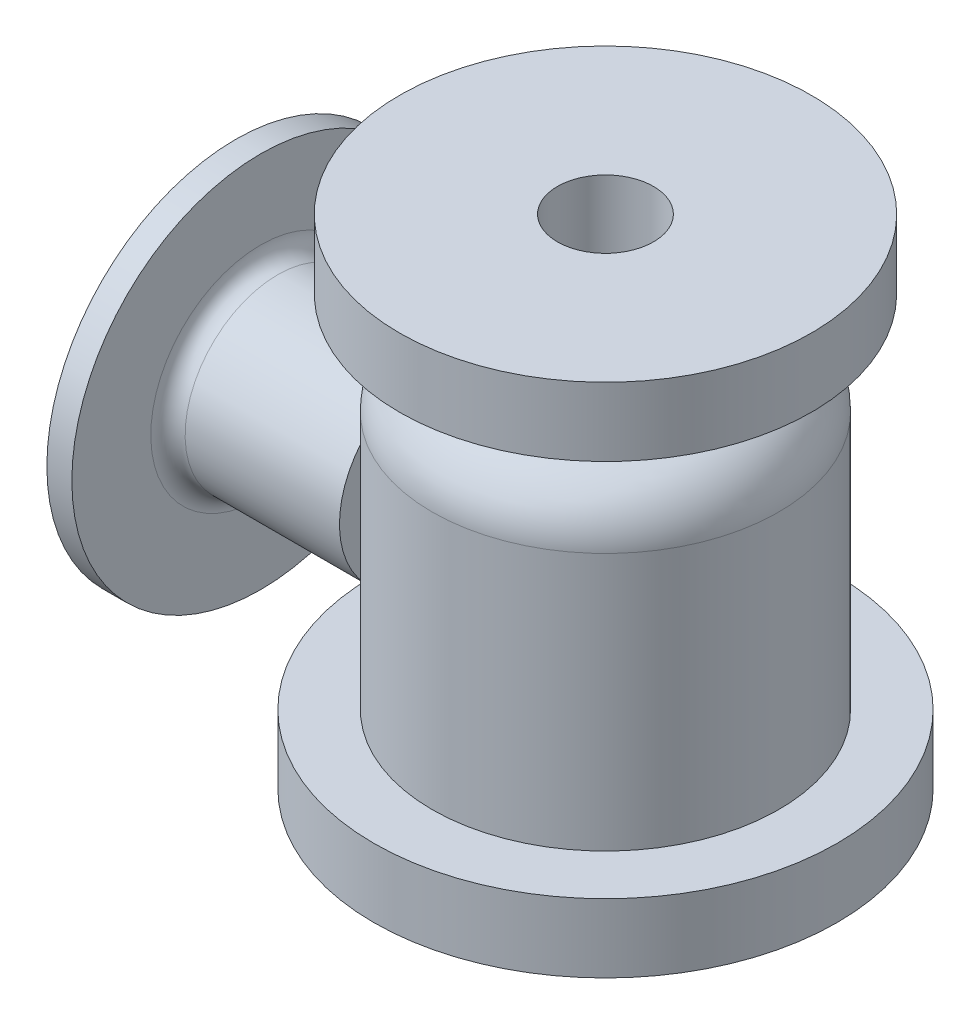
ISO-10303-21;
HEADER;
FILE_DESCRIPTION(('STEP AP214'),'2;1');
FILE_NAME('part.step','',(''),(''),'','','');
FILE_SCHEMA(('AUTOMOTIVE_DESIGN { 1 0 10303 214 1 1 1 1 }'));
ENDSEC;
DATA;
#1=APPLICATION_CONTEXT('core data for automotive mechanical design processes');
#2=APPLICATION_PROTOCOL_DEFINITION('international standard','automotive_design',2000,#1);
#3=PRODUCT_CONTEXT('',#1,'mechanical');
#4=PRODUCT('Part','Part','',(#3));
#5=PRODUCT_RELATED_PRODUCT_CATEGORY('part','',(#4));
#6=PRODUCT_DEFINITION_FORMATION('','',#4);
#7=PRODUCT_DEFINITION_CONTEXT('part definition',#1,'design');
#8=PRODUCT_DEFINITION('design','',#6,#7);
#9=PRODUCT_DEFINITION_SHAPE('','',#8);
#10=(LENGTH_UNIT() NAMED_UNIT(*) SI_UNIT(.MILLI.,.METRE.));
#11=(NAMED_UNIT(*) PLANE_ANGLE_UNIT() SI_UNIT($,.RADIAN.));
#12=(NAMED_UNIT(*) SI_UNIT($,.STERADIAN.) SOLID_ANGLE_UNIT());
#13=UNCERTAINTY_MEASURE_WITH_UNIT(LENGTH_MEASURE(1.E-05),#10,'distance_accuracy_value','');
#14=(GEOMETRIC_REPRESENTATION_CONTEXT(3) GLOBAL_UNCERTAINTY_ASSIGNED_CONTEXT((#13)) GLOBAL_UNIT_ASSIGNED_CONTEXT((#10,
#11,#12)) REPRESENTATION_CONTEXT('',''));
#15=CARTESIAN_POINT('',(0.,0.,0.));
#16=DIRECTION('',(0.,0.,1.));
#17=DIRECTION('',(1.,0.,0.));
#18=AXIS2_PLACEMENT_3D('',#15,#16,#17);
#19=CARTESIAN_POINT('',(-200.93484632486,-11.,0.));
#20=DIRECTION('',(1.,0.,0.));
#21=DIRECTION('',(0.,1.,0.));
#22=AXIS2_PLACEMENT_3D('',#19,#20,#21);
#23=PLANE('',#22);
#24=CARTESIAN_POINT('',(-200.93484632486,-75.0000000000001,0.));
#25=DIRECTION('',(1.,0.,0.));
#26=DIRECTION('',(0.,1.,0.));
#27=AXIS2_PLACEMENT_3D('',#24,#25,#26);
#28=CIRCLE('',#27,110.);
#29=CARTESIAN_POINT('',(-200.93484632486,35.,0.));
#30=VERTEX_POINT('',#29);
#31=EDGE_CURVE('E67',#30,#30,#28,.T.);
#32=ORIENTED_EDGE('',*,*,#31,.T.);
#33=EDGE_LOOP('',(#32));
#34=FACE_BOUND('',#33,.T.);
#35=CARTESIAN_POINT('',(-200.93484632486,-75.0000000000001,0.));
#36=DIRECTION('',(1.,0.,0.));
#37=DIRECTION('',(0.,1.,0.));
#38=AXIS2_PLACEMENT_3D('',#35,#36,#37);
#39=CIRCLE('',#38,64.);
#40=CARTESIAN_POINT('',(-200.93484632486,-11.0000000000001,0.));
#41=VERTEX_POINT('',#40);
#42=EDGE_CURVE('E11',#41,#41,#39,.T.);
#43=ORIENTED_EDGE('',*,*,#42,.F.);
#44=EDGE_LOOP('',(#43));
#45=FACE_BOUND('',#44,.T.);
#46=ADVANCED_FACE('F42',(#34,#45),#23,.T.);
#47=CARTESIAN_POINT('',(-190.93484632486,-75.0000000000001,0.));
#48=DIRECTION('',(1.,0.,0.));
#49=DIRECTION('',(0.,1.,0.));
#50=AXIS2_PLACEMENT_3D('',#47,#48,#49);
#51=TOROIDAL_SURFACE('',#50,64.,10.);
#52=ORIENTED_EDGE('',*,*,#42,.T.);
#53=EDGE_LOOP('',(#52));
#54=FACE_BOUND('',#53,.T.);
#55=CARTESIAN_POINT('',(-190.93484632486,-75.0000000000001,0.));
#56=DIRECTION('',(1.,0.,0.));
#57=DIRECTION('',(0.,1.,0.));
#58=AXIS2_PLACEMENT_3D('',#55,#56,#57);
#59=CIRCLE('',#58,54.);
#60=CARTESIAN_POINT('',(-190.93484632486,-21.,0.));
#61=VERTEX_POINT('',#60);
#62=EDGE_CURVE('E48',#61,#61,#59,.T.);
#63=ORIENTED_EDGE('',*,*,#62,.F.);
#64=EDGE_LOOP('',(#63));
#65=FACE_BOUND('',#64,.T.);
#66=ADVANCED_FACE('F85',(#54,#65),#51,.F.);
#67=CARTESIAN_POINT('',(0.,-75.,0.));
#68=DIRECTION('',(1.,0.,0.));
#69=DIRECTION('',(0.,1.,0.));
#70=AXIS2_PLACEMENT_3D('',#67,#68,#69);
#71=CYLINDRICAL_SURFACE('',#70,54.);
#72=ORIENTED_EDGE('',*,*,#62,.T.);
#73=EDGE_LOOP('',(#72));
#74=FACE_BOUND('',#73,.T.);
#75=CARTESIAN_POINT('',(-101.,-75.,0.));
#76=DIRECTION('',(1.,0.,0.));
#77=DIRECTION('',(0.,1.,0.));
#78=AXIS2_PLACEMENT_3D('',#75,#76,#77);
#79=CIRCLE('',#78,54.);
#80=CARTESIAN_POINT('',(-101.,-21.,0.));
#81=VERTEX_POINT('',#80);
#82=EDGE_CURVE('E52',#81,#81,#79,.T.);
#83=ORIENTED_EDGE('',*,*,#82,.F.);
#84=EDGE_LOOP('',(#83));
#85=FACE_BOUND('',#84,.T.);
#86=ADVANCED_FACE('F89',(#74,#85),#71,.T.);
#87=CARTESIAN_POINT('',(-101.,-37.0000000000001,0.));
#88=DIRECTION('',(1.,0.,0.));
#89=DIRECTION('',(0.,1.,0.));
#90=AXIS2_PLACEMENT_3D('',#87,#88,#89);
#91=PLANE('',#90);
#92=ORIENTED_EDGE('',*,*,#82,.T.);
#93=EDGE_LOOP('',(#92));
#94=FACE_BOUND('',#93,.T.);
#95=CARTESIAN_POINT('',(-101.,-75.,0.));
#96=DIRECTION('',(1.,0.,0.));
#97=DIRECTION('',(0.,1.,0.));
#98=AXIS2_PLACEMENT_3D('',#95,#96,#97);
#99=CIRCLE('',#98,38.);
#100=CARTESIAN_POINT('',(-101.,-37.0000000000001,0.));
#101=VERTEX_POINT('',#100);
#102=EDGE_CURVE('E56',#101,#101,#99,.T.);
#103=ORIENTED_EDGE('',*,*,#102,.F.);
#104=EDGE_LOOP('',(#103));
#105=FACE_BOUND('',#104,.T.);
#106=ADVANCED_FACE('F93',(#94,#105),#91,.T.);
#107=CARTESIAN_POINT('',(0.,-75.,0.));
#108=DIRECTION('',(1.,0.,0.));
#109=DIRECTION('',(0.,1.,0.));
#110=AXIS2_PLACEMENT_3D('',#107,#108,#109);
#111=CYLINDRICAL_SURFACE('',#110,38.);
#112=ORIENTED_EDGE('',*,*,#102,.T.);
#113=EDGE_LOOP('',(#112));
#114=FACE_BOUND('',#113,.T.);
#115=CARTESIAN_POINT('',(-215.491575165988,-75.0000000000001,0.));
#116=DIRECTION('',(1.,0.,0.));
#117=DIRECTION('',(0.,1.,0.));
#118=AXIS2_PLACEMENT_3D('',#115,#116,#117);
#119=CIRCLE('',#118,38.);
#120=CARTESIAN_POINT('',(-215.491575165988,-37.0000000000001,0.));
#121=VERTEX_POINT('',#120);
#122=EDGE_CURVE('E61',#121,#121,#119,.T.);
#123=ORIENTED_EDGE('',*,*,#122,.F.);
#124=EDGE_LOOP('',(#123));
#125=FACE_BOUND('',#124,.T.);
#126=ADVANCED_FACE('F81',(#114,#125),#111,.F.);
#127=CARTESIAN_POINT('',(-215.491575165988,35.,0.));
#128=DIRECTION('',(-1.,0.,0.));
#129=DIRECTION('',(0.,-1.,0.));
#130=AXIS2_PLACEMENT_3D('',#127,#128,#129);
#131=PLANE('',#130);
#132=ORIENTED_EDGE('',*,*,#122,.T.);
#133=EDGE_LOOP('',(#132));
#134=FACE_BOUND('',#133,.T.);
#135=CARTESIAN_POINT('',(-215.491575165988,-75.0000000000001,0.));
#136=DIRECTION('',(1.,0.,0.));
#137=DIRECTION('',(0.,1.,0.));
#138=AXIS2_PLACEMENT_3D('',#135,#136,#137);
#139=CIRCLE('',#138,110.);
#140=CARTESIAN_POINT('',(-215.491575165988,35.,0.));
#141=VERTEX_POINT('',#140);
#142=EDGE_CURVE('E64',#141,#141,#139,.T.);
#143=ORIENTED_EDGE('',*,*,#142,.F.);
#144=EDGE_LOOP('',(#143));
#145=FACE_BOUND('',#144,.T.);
#146=ADVANCED_FACE('F75',(#134,#145),#131,.T.);
#147=CARTESIAN_POINT('',(0.,-75.,0.));
#148=DIRECTION('',(1.,0.,0.));
#149=DIRECTION('',(0.,1.,0.));
#150=AXIS2_PLACEMENT_3D('',#147,#148,#149);
#151=CYLINDRICAL_SURFACE('',#150,110.);
#152=ORIENTED_EDGE('',*,*,#142,.T.);
#153=EDGE_LOOP('',(#152));
#154=FACE_BOUND('',#153,.T.);
#155=ORIENTED_EDGE('',*,*,#31,.F.);
#156=EDGE_LOOP('',(#155));
#157=FACE_BOUND('',#156,.T.);
#158=ADVANCED_FACE('F73',(#154,#157),#151,.T.);
#159=CLOSED_SHELL('',(#46,#66,#86,#106,#126,#146,#158));
#160=MANIFOLD_SOLID_BREP('B2',#159);
#161=CARTESIAN_POINT('',(65.,-10.,0.));
#162=DIRECTION('',(0.,1.,0.));
#163=DIRECTION('',(0.,0.,1.));
#164=AXIS2_PLACEMENT_3D('',#161,#162,#163);
#165=PLANE('',#164);
#166=CARTESIAN_POINT('',(0.,-10.,0.));
#167=DIRECTION('',(0.,1.,0.));
#168=DIRECTION('',(0.,0.,1.));
#169=AXIS2_PLACEMENT_3D('',#166,#167,#168);
#170=CIRCLE('',#169,65.);
#171=CARTESIAN_POINT('',(0.,-10.,65.));
#172=VERTEX_POINT('',#171);
#173=EDGE_CURVE('E213',#172,#172,#170,.T.);
#174=ORIENTED_EDGE('',*,*,#173,.F.);
#175=EDGE_LOOP('',(#174));
#176=FACE_BOUND('',#175,.T.);
#177=CARTESIAN_POINT('',(0.,-10.,0.));
#178=DIRECTION('',(0.,1.,0.));
#179=DIRECTION('',(0.,0.,1.));
#180=AXIS2_PLACEMENT_3D('',#177,#178,#179);
#181=CIRCLE('',#180,47.);
#182=CARTESIAN_POINT('',(0.,-10.,47.));
#183=VERTEX_POINT('',#182);
#184=EDGE_CURVE('E41',#183,#183,#181,.T.);
#185=ORIENTED_EDGE('',*,*,#184,.T.);
#186=EDGE_LOOP('',(#185));
#187=FACE_BOUND('',#186,.T.);
#188=ADVANCED_FACE('F149',(#176,#187),#165,.F.);
#189=CARTESIAN_POINT('',(0.,130.544189359488,0.));
#190=DIRECTION('',(0.,1.,0.));
#191=DIRECTION('',(0.,0.,1.));
#192=AXIS2_PLACEMENT_3D('',#189,#190,#191);
#193=CYLINDRICAL_SURFACE('',#192,47.);
#194=ORIENTED_EDGE('',*,*,#184,.F.);
#195=EDGE_LOOP('',(#194));
#196=FACE_BOUND('',#195,.T.);
#197=CARTESIAN_POINT('',(0.,0.,0.));
#198=DIRECTION('',(0.,1.,0.));
#199=DIRECTION('',(0.,0.,1.));
#200=AXIS2_PLACEMENT_3D('',#197,#198,#199);
#201=CIRCLE('',#200,47.);
#202=CARTESIAN_POINT('',(0.,0.,47.));
#203=VERTEX_POINT('',#202);
#204=EDGE_CURVE('E155',#203,#203,#201,.T.);
#205=ORIENTED_EDGE('',*,*,#204,.T.);
#206=EDGE_LOOP('',(#205));
#207=FACE_BOUND('',#206,.T.);
#208=ADVANCED_FACE('F386',(#196,#207),#193,.F.);
#209=CARTESIAN_POINT('',(65.,0.,0.));
#210=DIRECTION('',(0.,1.,0.));
#211=DIRECTION('',(0.,0.,1.));
#212=AXIS2_PLACEMENT_3D('',#209,#210,#211);
#213=PLANE('',#212);
#214=ORIENTED_EDGE('',*,*,#204,.F.);
#215=EDGE_LOOP('',(#214));
#216=FACE_BOUND('',#215,.T.);
#217=CARTESIAN_POINT('',(0.,0.,0.));
#218=DIRECTION('',(0.,1.,0.));
#219=DIRECTION('',(0.,0.,1.));
#220=AXIS2_PLACEMENT_3D('',#217,#218,#219);
#221=CIRCLE('',#220,43.857864376269);
#222=CARTESIAN_POINT('',(0.,0.,43.857864376269));
#223=VERTEX_POINT('',#222);
#224=EDGE_CURVE('E159',#223,#223,#221,.T.);
#225=ORIENTED_EDGE('',*,*,#224,.T.);
#226=EDGE_LOOP('',(#225));
#227=FACE_BOUND('',#226,.T.);
#228=ADVANCED_FACE('F383',(#216,#227),#213,.F.);
#229=CARTESIAN_POINT('',(0.,7.85786437626906,0.));
#230=DIRECTION('',(0.,-1.,0.));
#231=DIRECTION('',(0.,0.,-1.));
#232=AXIS2_PLACEMENT_3D('',#229,#230,#231);
#233=CONICAL_SURFACE('',#232,36.,0.785398163397447);
#234=ORIENTED_EDGE('',*,*,#224,.F.);
#235=EDGE_LOOP('',(#234));
#236=FACE_BOUND('',#235,.T.);
#237=CARTESIAN_POINT('',(0.,7.85786437626906,0.));
#238=DIRECTION('',(0.,1.,0.));
#239=DIRECTION('',(0.,0.,1.));
#240=AXIS2_PLACEMENT_3D('',#237,#238,#239);
#241=CIRCLE('',#240,36.);
#242=CARTESIAN_POINT('',(0.,7.85786437626906,36.));
#243=VERTEX_POINT('',#242);
#244=EDGE_CURVE('E163',#243,#243,#241,.T.);
#245=ORIENTED_EDGE('',*,*,#244,.T.);
#246=EDGE_LOOP('',(#245));
#247=FACE_BOUND('',#246,.T.);
#248=ADVANCED_FACE('F379',(#236,#247),#233,.F.);
#249=CARTESIAN_POINT('',(0.,130.544189359488,0.));
#250=DIRECTION('',(0.,1.,0.));
#251=DIRECTION('',(0.,0.,1.));
#252=AXIS2_PLACEMENT_3D('',#249,#250,#251);
#253=CYLINDRICAL_SURFACE('',#252,36.);
#254=ORIENTED_EDGE('',*,*,#244,.F.);
#255=EDGE_LOOP('',(#254));
#256=FACE_BOUND('',#255,.T.);
#257=CARTESIAN_POINT('',(0.,54.,0.));
#258=DIRECTION('',(0.,1.,0.));
#259=DIRECTION('',(0.,0.,1.));
#260=AXIS2_PLACEMENT_3D('',#257,#258,#259);
#261=CIRCLE('',#260,36.);
#262=CARTESIAN_POINT('',(0.,54.,36.));
#263=VERTEX_POINT('',#262);
#264=EDGE_CURVE('E168',#263,#263,#261,.T.);
#265=ORIENTED_EDGE('',*,*,#264,.T.);
#266=EDGE_LOOP('',(#265));
#267=FACE_BOUND('',#266,.T.);
#268=ADVANCED_FACE('F375',(#256,#267),#253,.F.);
#269=CARTESIAN_POINT('',(65.,54.,0.));
#270=DIRECTION('',(0.,1.,0.));
#271=DIRECTION('',(0.,0.,1.));
#272=AXIS2_PLACEMENT_3D('',#269,#270,#271);
#273=PLANE('',#272);
#274=ORIENTED_EDGE('',*,*,#264,.F.);
#275=EDGE_LOOP('',(#274));
#276=FACE_BOUND('',#275,.T.);
#277=CARTESIAN_POINT('',(0.,54.,0.));
#278=DIRECTION('',(0.,1.,0.));
#279=DIRECTION('',(0.,0.,1.));
#280=AXIS2_PLACEMENT_3D('',#277,#278,#279);
#281=CIRCLE('',#280,28.);
#282=CARTESIAN_POINT('',(0.,54.,28.));
#283=VERTEX_POINT('',#282);
#284=EDGE_CURVE('E171',#283,#283,#281,.T.);
#285=ORIENTED_EDGE('',*,*,#284,.T.);
#286=EDGE_LOOP('',(#285));
#287=FACE_BOUND('',#286,.T.);
#288=ADVANCED_FACE('F371',(#276,#287),#273,.F.);
#289=CARTESIAN_POINT('',(0.,130.544189359488,0.));
#290=DIRECTION('',(0.,1.,0.));
#291=DIRECTION('',(0.,0.,1.));
#292=AXIS2_PLACEMENT_3D('',#289,#290,#291);
#293=CYLINDRICAL_SURFACE('',#292,28.);
#294=ORIENTED_EDGE('',*,*,#284,.F.);
#295=EDGE_LOOP('',(#294));
#296=FACE_BOUND('',#295,.T.);
#297=CARTESIAN_POINT('',(0.,105.,0.));
#298=DIRECTION('',(0.,1.,0.));
#299=DIRECTION('',(0.,0.,1.));
#300=AXIS2_PLACEMENT_3D('',#297,#298,#299);
#301=CIRCLE('',#300,28.);
#302=CARTESIAN_POINT('',(0.,105.,28.));
#303=VERTEX_POINT('',#302);
#304=EDGE_CURVE('E174',#303,#303,#301,.T.);
#305=ORIENTED_EDGE('',*,*,#304,.T.);
#306=EDGE_LOOP('',(#305));
#307=FACE_BOUND('',#306,.T.);
#308=ADVANCED_FACE('F367',(#296,#307),#293,.F.);
#309=CARTESIAN_POINT('',(65.,105.,0.));
#310=DIRECTION('',(0.,-1.,0.));
#311=DIRECTION('',(0.,0.,-1.));
#312=AXIS2_PLACEMENT_3D('',#309,#310,#311);
#313=PLANE('',#312);
#314=ORIENTED_EDGE('',*,*,#304,.F.);
#315=EDGE_LOOP('',(#314));
#316=FACE_BOUND('',#315,.T.);
#317=CARTESIAN_POINT('',(0.,105.,0.));
#318=DIRECTION('',(0.,1.,0.));
#319=DIRECTION('',(0.,0.,1.));
#320=AXIS2_PLACEMENT_3D('',#317,#318,#319);
#321=CIRCLE('',#320,120.);
#322=CARTESIAN_POINT('',(0.,105.,120.));
#323=VERTEX_POINT('',#322);
#324=EDGE_CURVE('E177',#323,#323,#321,.T.);
#325=ORIENTED_EDGE('',*,*,#324,.T.);
#326=EDGE_LOOP('',(#325));
#327=FACE_BOUND('',#326,.T.);
#328=ADVANCED_FACE('F363',(#316,#327),#313,.F.);
#329=CARTESIAN_POINT('',(0.,130.544189359488,0.));
#330=DIRECTION('',(0.,1.,0.));
#331=DIRECTION('',(0.,0.,1.));
#332=AXIS2_PLACEMENT_3D('',#329,#330,#331);
#333=CYLINDRICAL_SURFACE('',#332,120.);
#334=ORIENTED_EDGE('',*,*,#324,.F.);
#335=EDGE_LOOP('',(#334));
#336=FACE_BOUND('',#335,.T.);
#337=CARTESIAN_POINT('',(0.,65.,0.));
#338=DIRECTION('',(0.,1.,0.));
#339=DIRECTION('',(0.,0.,1.));
#340=AXIS2_PLACEMENT_3D('',#337,#338,#339);
#341=CIRCLE('',#340,120.);
#342=CARTESIAN_POINT('',(0.,65.,120.));
#343=VERTEX_POINT('',#342);
#344=EDGE_CURVE('E180',#343,#343,#341,.T.);
#345=ORIENTED_EDGE('',*,*,#344,.T.);
#346=EDGE_LOOP('',(#345));
#347=FACE_BOUND('',#346,.T.);
#348=ADVANCED_FACE('F359',(#336,#347),#333,.T.);
#349=CARTESIAN_POINT('',(65.,65.,0.));
#350=DIRECTION('',(0.,1.,0.));
#351=DIRECTION('',(0.,0.,1.));
#352=AXIS2_PLACEMENT_3D('',#349,#350,#351);
#353=PLANE('',#352);
#354=ORIENTED_EDGE('',*,*,#344,.F.);
#355=EDGE_LOOP('',(#354));
#356=FACE_BOUND('',#355,.T.);
#357=CARTESIAN_POINT('',(0.,65.,0.));
#358=DIRECTION('',(0.,1.,0.));
#359=DIRECTION('',(0.,0.,1.));
#360=AXIS2_PLACEMENT_3D('',#357,#358,#359);
#361=CIRCLE('',#360,72.);
#362=CARTESIAN_POINT('',(0.,65.,72.));
#363=VERTEX_POINT('',#362);
#364=EDGE_CURVE('E183',#363,#363,#361,.T.);
#365=ORIENTED_EDGE('',*,*,#364,.T.);
#366=EDGE_LOOP('',(#365));
#367=FACE_BOUND('',#366,.T.);
#368=ADVANCED_FACE('F355',(#356,#367),#353,.F.);
#369=CARTESIAN_POINT('',(0.,130.544189359488,0.));
#370=DIRECTION('',(0.,1.,0.));
#371=DIRECTION('',(0.,0.,1.));
#372=AXIS2_PLACEMENT_3D('',#369,#370,#371);
#373=CYLINDRICAL_SURFACE('',#372,72.);
#374=ORIENTED_EDGE('',*,*,#364,.F.);
#375=EDGE_LOOP('',(#374));
#376=FACE_BOUND('',#375,.T.);
#377=CARTESIAN_POINT('',(0.,51.8097625055954,0.));
#378=DIRECTION('',(0.,1.,0.));
#379=DIRECTION('',(0.,0.,1.));
#380=AXIS2_PLACEMENT_3D('',#377,#378,#379);
#381=CIRCLE('',#380,72.);
#382=CARTESIAN_POINT('',(0.,51.8097625055954,72.));
#383=VERTEX_POINT('',#382);
#384=EDGE_CURVE('E186',#383,#383,#381,.T.);
#385=ORIENTED_EDGE('',*,*,#384,.T.);
#386=EDGE_LOOP('',(#385));
#387=FACE_BOUND('',#386,.T.);
#388=ADVANCED_FACE('F351',(#376,#387),#373,.T.);
#389=CARTESIAN_POINT('',(0.,51.8097625055954,0.));
#390=DIRECTION('',(0.,1.,0.));
#391=DIRECTION('',(0.,0.,1.));
#392=AXIS2_PLACEMENT_3D('',#389,#390,#391);
#393=TOROIDAL_SURFACE('',#392,88.,16.);
#394=ORIENTED_EDGE('',*,*,#384,.F.);
#395=EDGE_LOOP('',(#394));
#396=FACE_BOUND('',#395,.T.);
#397=CARTESIAN_POINT('',(0.,37.4599485777665,0.));
#398=DIRECTION('',(0.,1.,0.));
#399=DIRECTION('',(0.,0.,1.));
#400=AXIS2_PLACEMENT_3D('',#397,#398,#399);
#401=CIRCLE('',#400,80.9230769230769);
#402=CARTESIAN_POINT('',(0.,37.4599485777665,80.9230769230769));
#403=VERTEX_POINT('',#402);
#404=EDGE_CURVE('E189',#403,#403,#401,.T.);
#405=ORIENTED_EDGE('',*,*,#404,.T.);
#406=EDGE_LOOP('',(#405));
#407=FACE_BOUND('',#406,.T.);
#408=ADVANCED_FACE('F347',(#396,#407),#393,.F.);
#409=CARTESIAN_POINT('',(0.,5.17286724015136,0.));
#410=DIRECTION('',(0.,1.,0.));
#411=DIRECTION('',(0.,0.,1.));
#412=AXIS2_PLACEMENT_3D('',#409,#410,#411);
#413=TOROIDAL_SURFACE('',#412,65.,36.);
#414=ORIENTED_EDGE('',*,*,#404,.F.);
#415=EDGE_LOOP('',(#414));
#416=FACE_BOUND('',#415,.T.);
#417=CARTESIAN_POINT('',(0.,5.17286724015117,0.));
#418=DIRECTION('',(0.,1.,0.));
#419=DIRECTION('',(0.,0.,1.));
#420=AXIS2_PLACEMENT_3D('',#417,#418,#419);
#421=CIRCLE('',#420,101.);
#422=CARTESIAN_POINT('',(0.,5.17286724015117,101.));
#423=VERTEX_POINT('',#422);
#424=EDGE_CURVE('E192',#423,#423,#421,.T.);
#425=ORIENTED_EDGE('',*,*,#424,.T.);
#426=EDGE_LOOP('',(#425));
#427=FACE_BOUND('',#426,.T.);
#428=ADVANCED_FACE('F343',(#416,#427),#413,.T.);
#429=CARTESIAN_POINT('',(0.,130.544189359488,0.));
#430=DIRECTION('',(0.,1.,0.));
#431=DIRECTION('',(0.,0.,1.));
#432=AXIS2_PLACEMENT_3D('',#429,#430,#431);
#433=CYLINDRICAL_SURFACE('',#432,101.);
#434=ORIENTED_EDGE('',*,*,#424,.F.);
#435=EDGE_LOOP('',(#434));
#436=FACE_BOUND('',#435,.T.);
#437=CARTESIAN_POINT('',(0.,-145.,0.));
#438=DIRECTION('',(0.,1.,0.));
#439=DIRECTION('',(0.,0.,1.));
#440=AXIS2_PLACEMENT_3D('',#437,#438,#439);
#441=CIRCLE('',#440,101.);
#442=CARTESIAN_POINT('',(0.,-145.,101.));
#443=VERTEX_POINT('',#442);
#444=EDGE_CURVE('E195',#443,#443,#441,.T.);
#445=ORIENTED_EDGE('',*,*,#444,.T.);
#446=EDGE_LOOP('',(#445));
#447=FACE_BOUND('',#446,.T.);
#448=ADVANCED_FACE('F339',(#436,#447),#433,.T.);
#449=CARTESIAN_POINT('',(65.,-145.,0.));
#450=DIRECTION('',(0.,-1.,0.));
#451=DIRECTION('',(0.,0.,-1.));
#452=AXIS2_PLACEMENT_3D('',#449,#450,#451);
#453=PLANE('',#452);
#454=ORIENTED_EDGE('',*,*,#444,.F.);
#455=EDGE_LOOP('',(#454));
#456=FACE_BOUND('',#455,.T.);
#457=CARTESIAN_POINT('',(0.,-145.,0.));
#458=DIRECTION('',(0.,1.,0.));
#459=DIRECTION('',(0.,0.,1.));
#460=AXIS2_PLACEMENT_3D('',#457,#458,#459);
#461=CIRCLE('',#460,135.);
#462=CARTESIAN_POINT('',(0.,-145.,135.));
#463=VERTEX_POINT('',#462);
#464=EDGE_CURVE('E198',#463,#463,#461,.T.);
#465=ORIENTED_EDGE('',*,*,#464,.T.);
#466=EDGE_LOOP('',(#465));
#467=FACE_BOUND('',#466,.T.);
#468=ADVANCED_FACE('F335',(#456,#467),#453,.F.);
#469=CARTESIAN_POINT('',(0.,130.544189359488,0.));
#470=DIRECTION('',(0.,1.,0.));
#471=DIRECTION('',(0.,0.,1.));
#472=AXIS2_PLACEMENT_3D('',#469,#470,#471);
#473=CYLINDRICAL_SURFACE('',#472,135.);
#474=ORIENTED_EDGE('',*,*,#464,.F.);
#475=EDGE_LOOP('',(#474));
#476=FACE_BOUND('',#475,.T.);
#477=CARTESIAN_POINT('',(0.,-185.,0.));
#478=DIRECTION('',(0.,1.,0.));
#479=DIRECTION('',(0.,0.,1.));
#480=AXIS2_PLACEMENT_3D('',#477,#478,#479);
#481=CIRCLE('',#480,135.);
#482=CARTESIAN_POINT('',(0.,-185.,135.));
#483=VERTEX_POINT('',#482);
#484=EDGE_CURVE('E201',#483,#483,#481,.T.);
#485=ORIENTED_EDGE('',*,*,#484,.T.);
#486=EDGE_LOOP('',(#485));
#487=FACE_BOUND('',#486,.T.);
#488=ADVANCED_FACE('F331',(#476,#487),#473,.T.);
#489=CARTESIAN_POINT('',(65.,-185.,0.));
#490=DIRECTION('',(0.,1.,0.));
#491=DIRECTION('',(0.,0.,1.));
#492=AXIS2_PLACEMENT_3D('',#489,#490,#491);
#493=PLANE('',#492);
#494=ORIENTED_EDGE('',*,*,#484,.F.);
#495=EDGE_LOOP('',(#494));
#496=FACE_BOUND('',#495,.T.);
#497=CARTESIAN_POINT('',(0.,-185.,0.));
#498=DIRECTION('',(0.,1.,0.));
#499=DIRECTION('',(0.,0.,1.));
#500=AXIS2_PLACEMENT_3D('',#497,#498,#499);
#501=CIRCLE('',#500,69.);
#502=CARTESIAN_POINT('',(0.,-185.,69.));
#503=VERTEX_POINT('',#502);
#504=EDGE_CURVE('E204',#503,#503,#501,.T.);
#505=ORIENTED_EDGE('',*,*,#504,.T.);
#506=EDGE_LOOP('',(#505));
#507=FACE_BOUND('',#506,.T.);
#508=ADVANCED_FACE('F327',(#496,#507),#493,.F.);
#509=CARTESIAN_POINT('',(0.,130.544189359488,0.));
#510=DIRECTION('',(0.,1.,0.));
#511=DIRECTION('',(0.,0.,1.));
#512=AXIS2_PLACEMENT_3D('',#509,#510,#511);
#513=CYLINDRICAL_SURFACE('',#512,69.);
#514=ORIENTED_EDGE('',*,*,#504,.F.);
#515=EDGE_LOOP('',(#514));
#516=FACE_BOUND('',#515,.T.);
#517=CARTESIAN_POINT('',(0.,-176.,0.));
#518=DIRECTION('',(0.,1.,0.));
#519=DIRECTION('',(0.,0.,1.));
#520=AXIS2_PLACEMENT_3D('',#517,#518,#519);
#521=CIRCLE('',#520,69.);
#522=CARTESIAN_POINT('',(0.,-176.,69.));
#523=VERTEX_POINT('',#522);
#524=EDGE_CURVE('E207',#523,#523,#521,.T.);
#525=ORIENTED_EDGE('',*,*,#524,.T.);
#526=EDGE_LOOP('',(#525));
#527=FACE_BOUND('',#526,.T.);
#528=ADVANCED_FACE('F323',(#516,#527),#513,.F.);
#529=CARTESIAN_POINT('',(65.,-176.,0.));
#530=DIRECTION('',(0.,1.,0.));
#531=DIRECTION('',(0.,0.,1.));
#532=AXIS2_PLACEMENT_3D('',#529,#530,#531);
#533=PLANE('',#532);
#534=ORIENTED_EDGE('',*,*,#524,.F.);
#535=EDGE_LOOP('',(#534));
#536=FACE_BOUND('',#535,.T.);
#537=CARTESIAN_POINT('',(0.,-176.,0.));
#538=DIRECTION('',(0.,1.,0.));
#539=DIRECTION('',(0.,0.,1.));
#540=AXIS2_PLACEMENT_3D('',#537,#538,#539);
#541=CIRCLE('',#540,65.);
#542=CARTESIAN_POINT('',(0.,-176.,65.));
#543=VERTEX_POINT('',#542);
#544=EDGE_CURVE('E210',#543,#543,#541,.T.);
#545=ORIENTED_EDGE('',*,*,#544,.T.);
#546=EDGE_LOOP('',(#545));
#547=FACE_BOUND('',#546,.T.);
#548=ADVANCED_FACE('F319',(#536,#547),#533,.F.);
#549=CARTESIAN_POINT('',(0.,130.544189359488,0.));
#550=DIRECTION('',(0.,1.,0.));
#551=DIRECTION('',(0.,0.,1.));
#552=AXIS2_PLACEMENT_3D('',#549,#550,#551);
#553=CYLINDRICAL_SURFACE('',#552,65.);
#554=ORIENTED_EDGE('',*,*,#544,.F.);
#555=EDGE_LOOP('',(#554));
#556=FACE_BOUND('',#555,.T.);
#557=ORIENTED_EDGE('',*,*,#173,.T.);
#558=EDGE_LOOP('',(#557));
#559=FACE_BOUND('',#558,.T.);
#560=ADVANCED_FACE('F317',(#556,#559),#553,.F.);
#561=CLOSED_SHELL('',(#188,#208,#228,#248,#268,#288,#308,#328,#348,#368,#388,#408,#428,#448,
#468,#488,#508,#528,#548,#560));
#562=CARTESIAN_POINT('',(57.,0.,0.));
#563=DIRECTION('',(0.,1.,0.));
#564=DIRECTION('',(0.,0.,1.));
#565=AXIS2_PLACEMENT_3D('',#562,#563,#564);
#566=PLANE('',#565);
#567=CARTESIAN_POINT('',(0.,0.,0.));
#568=DIRECTION('',(0.,1.,0.));
#569=DIRECTION('',(0.,0.,1.));
#570=AXIS2_PLACEMENT_3D('',#567,#568,#569);
#571=CIRCLE('',#570,64.9999999999999);
#572=CARTESIAN_POINT('',(0.,0.,64.9999999999999));
#573=VERTEX_POINT('',#572);
#574=EDGE_CURVE('E285',#573,#573,#571,.T.);
#575=ORIENTED_EDGE('',*,*,#574,.T.);
#576=EDGE_LOOP('',(#575));
#577=FACE_BOUND('',#576,.T.);
#578=CARTESIAN_POINT('',(0.,0.,0.));
#579=DIRECTION('',(0.,1.,0.));
#580=DIRECTION('',(0.,0.,1.));
#581=AXIS2_PLACEMENT_3D('',#578,#579,#580);
#582=CIRCLE('',#581,57.);
#583=CARTESIAN_POINT('',(0.,0.,57.));
#584=VERTEX_POINT('',#583);
#585=EDGE_CURVE('E216',#584,#584,#582,.T.);
#586=ORIENTED_EDGE('',*,*,#585,.F.);
#587=EDGE_LOOP('',(#586));
#588=FACE_BOUND('',#587,.T.);
#589=ADVANCED_FACE('F289',(#577,#588),#566,.T.);
#590=CARTESIAN_POINT('',(0.,130.544189359488,0.));
#591=DIRECTION('',(0.,1.,0.));
#592=DIRECTION('',(0.,0.,1.));
#593=AXIS2_PLACEMENT_3D('',#590,#591,#592);
#594=CYLINDRICAL_SURFACE('',#593,57.);
#595=ORIENTED_EDGE('',*,*,#585,.T.);
#596=EDGE_LOOP('',(#595));
#597=FACE_BOUND('',#596,.T.);
#598=CARTESIAN_POINT('',(0.,9.99999999999999,0.));
#599=DIRECTION('',(0.,1.,0.));
#600=DIRECTION('',(0.,0.,1.));
#601=AXIS2_PLACEMENT_3D('',#598,#599,#600);
#602=CIRCLE('',#601,57.);
#603=CARTESIAN_POINT('',(0.,9.99999999999999,57.));
#604=VERTEX_POINT('',#603);
#605=EDGE_CURVE('E219',#604,#604,#602,.T.);
#606=ORIENTED_EDGE('',*,*,#605,.F.);
#607=EDGE_LOOP('',(#606));
#608=FACE_BOUND('',#607,.T.);
#609=ADVANCED_FACE('F306',(#597,#608),#594,.T.);
#610=CARTESIAN_POINT('',(48.,10.,0.));
#611=DIRECTION('',(0.,1.,0.));
#612=DIRECTION('',(0.,0.,1.));
#613=AXIS2_PLACEMENT_3D('',#610,#611,#612);
#614=PLANE('',#613);
#615=ORIENTED_EDGE('',*,*,#605,.T.);
#616=EDGE_LOOP('',(#615));
#617=FACE_BOUND('',#616,.T.);
#618=CARTESIAN_POINT('',(0.,10.,0.));
#619=DIRECTION('',(0.,1.,0.));
#620=DIRECTION('',(0.,0.,1.));
#621=AXIS2_PLACEMENT_3D('',#618,#619,#620);
#622=CIRCLE('',#621,48.);
#623=CARTESIAN_POINT('',(0.,10.,48.));
#624=VERTEX_POINT('',#623);
#625=EDGE_CURVE('E222',#624,#624,#622,.T.);
#626=ORIENTED_EDGE('',*,*,#625,.F.);
#627=EDGE_LOOP('',(#626));
#628=FACE_BOUND('',#627,.T.);
#629=ADVANCED_FACE('F312',(#617,#628),#614,.T.);
#630=CARTESIAN_POINT('',(0.,12.,0.));
#631=DIRECTION('',(0.,-1.,0.));
#632=DIRECTION('',(0.,0.,-1.));
#633=AXIS2_PLACEMENT_3D('',#630,#631,#632);
#634=CONICAL_SURFACE('',#633,46.,0.78539816339745);
#635=ORIENTED_EDGE('',*,*,#625,.T.);
#636=EDGE_LOOP('',(#635));
#637=FACE_BOUND('',#636,.T.);
#638=CARTESIAN_POINT('',(0.,12.,0.));
#639=DIRECTION('',(0.,1.,0.));
#640=DIRECTION('',(0.,0.,1.));
#641=AXIS2_PLACEMENT_3D('',#638,#639,#640);
#642=CIRCLE('',#641,46.);
#643=CARTESIAN_POINT('',(0.,12.,46.));
#644=VERTEX_POINT('',#643);
#645=EDGE_CURVE('E225',#644,#644,#642,.T.);
#646=ORIENTED_EDGE('',*,*,#645,.F.);
#647=EDGE_LOOP('',(#646));
#648=FACE_BOUND('',#647,.T.);
#649=ADVANCED_FACE('F524',(#637,#648),#634,.T.);
#650=CARTESIAN_POINT('',(0.,130.544189359488,0.));
#651=DIRECTION('',(0.,1.,0.));
#652=DIRECTION('',(0.,0.,1.));
#653=AXIS2_PLACEMENT_3D('',#650,#651,#652);
#654=CYLINDRICAL_SURFACE('',#653,46.);
#655=ORIENTED_EDGE('',*,*,#645,.T.);
#656=EDGE_LOOP('',(#655));
#657=FACE_BOUND('',#656,.T.);
#658=CARTESIAN_POINT('',(0.,59.,0.));
#659=DIRECTION('',(0.,1.,0.));
#660=DIRECTION('',(0.,0.,1.));
#661=AXIS2_PLACEMENT_3D('',#658,#659,#660);
#662=CIRCLE('',#661,46.);
#663=CARTESIAN_POINT('',(0.,59.,46.));
#664=VERTEX_POINT('',#663);
#665=EDGE_CURVE('E228',#664,#664,#662,.T.);
#666=ORIENTED_EDGE('',*,*,#665,.F.);
#667=EDGE_LOOP('',(#666));
#668=FACE_BOUND('',#667,.T.);
#669=ADVANCED_FACE('F533',(#657,#668),#654,.T.);
#670=CARTESIAN_POINT('',(0.,59.,0.));
#671=DIRECTION('',(0.,1.,0.));
#672=DIRECTION('',(0.,0.,1.));
#673=AXIS2_PLACEMENT_3D('',#670,#671,#672);
#674=TOROIDAL_SURFACE('',#673,41.,5.);
#675=CARTESIAN_POINT('',(0.,64.,0.));
#676=DIRECTION('',(0.,1.,0.));
#677=DIRECTION('',(0.,0.,1.));
#678=AXIS2_PLACEMENT_3D('',#675,#676,#677);
#679=CIRCLE('',#678,41.);
#680=CARTESIAN_POINT('',(0.,64.,41.));
#681=VERTEX_POINT('',#680);
#682=EDGE_CURVE('E231',#681,#681,#679,.T.);
#683=ORIENTED_EDGE('',*,*,#682,.F.);
#684=EDGE_LOOP('',(#683));
#685=FACE_BOUND('',#684,.T.);
#686=ORIENTED_EDGE('',*,*,#665,.T.);
#687=EDGE_LOOP('',(#686));
#688=FACE_BOUND('',#687,.T.);
#689=ADVANCED_FACE('F543',(#685,#688),#674,.T.);
#690=CARTESIAN_POINT('',(38.,64.,0.));
#691=DIRECTION('',(0.,1.,0.));
#692=DIRECTION('',(0.,0.,1.));
#693=AXIS2_PLACEMENT_3D('',#690,#691,#692);
#694=PLANE('',#693);
#695=ORIENTED_EDGE('',*,*,#682,.T.);
#696=EDGE_LOOP('',(#695));
#697=FACE_BOUND('',#696,.T.);
#698=CARTESIAN_POINT('',(0.,64.,0.));
#699=DIRECTION('',(0.,1.,0.));
#700=DIRECTION('',(0.,0.,1.));
#701=AXIS2_PLACEMENT_3D('',#698,#699,#700);
#702=CIRCLE('',#701,38.);
#703=CARTESIAN_POINT('',(0.,64.,38.));
#704=VERTEX_POINT('',#703);
#705=EDGE_CURVE('E234',#704,#704,#702,.T.);
#706=ORIENTED_EDGE('',*,*,#705,.F.);
#707=EDGE_LOOP('',(#706));
#708=FACE_BOUND('',#707,.T.);
#709=ADVANCED_FACE('F553',(#697,#708),#694,.T.);
#710=CARTESIAN_POINT('',(0.,130.544189359488,0.));
#711=DIRECTION('',(0.,1.,0.));
#712=DIRECTION('',(0.,0.,1.));
#713=AXIS2_PLACEMENT_3D('',#710,#711,#712);
#714=CYLINDRICAL_SURFACE('',#713,38.);
#715=ORIENTED_EDGE('',*,*,#705,.T.);
#716=EDGE_LOOP('',(#715));
#717=FACE_BOUND('',#716,.T.);
#718=CARTESIAN_POINT('',(0.,95.,0.));
#719=DIRECTION('',(0.,1.,0.));
#720=DIRECTION('',(0.,0.,1.));
#721=AXIS2_PLACEMENT_3D('',#718,#719,#720);
#722=CIRCLE('',#721,38.);
#723=CARTESIAN_POINT('',(0.,95.,38.));
#724=VERTEX_POINT('',#723);
#725=EDGE_CURVE('E237',#724,#724,#722,.T.);
#726=ORIENTED_EDGE('',*,*,#725,.F.);
#727=EDGE_LOOP('',(#726));
#728=FACE_BOUND('',#727,.T.);
#729=ADVANCED_FACE('F563',(#717,#728),#714,.T.);
#730=CARTESIAN_POINT('',(110.,95.,0.));
#731=DIRECTION('',(0.,-1.,0.));
#732=DIRECTION('',(0.,0.,-1.));
#733=AXIS2_PLACEMENT_3D('',#730,#731,#732);
#734=PLANE('',#733);
#735=ORIENTED_EDGE('',*,*,#725,.T.);
#736=EDGE_LOOP('',(#735));
#737=FACE_BOUND('',#736,.T.);
#738=CARTESIAN_POINT('',(0.,95.,0.));
#739=DIRECTION('',(0.,1.,0.));
#740=DIRECTION('',(0.,0.,1.));
#741=AXIS2_PLACEMENT_3D('',#738,#739,#740);
#742=CIRCLE('',#741,110.);
#743=CARTESIAN_POINT('',(0.,95.,110.));
#744=VERTEX_POINT('',#743);
#745=EDGE_CURVE('E240',#744,#744,#742,.T.);
#746=ORIENTED_EDGE('',*,*,#745,.F.);
#747=EDGE_LOOP('',(#746));
#748=FACE_BOUND('',#747,.T.);
#749=ADVANCED_FACE('F573',(#737,#748),#734,.T.);
#750=CARTESIAN_POINT('',(0.,130.544189359488,0.));
#751=DIRECTION('',(0.,1.,0.));
#752=DIRECTION('',(0.,0.,1.));
#753=AXIS2_PLACEMENT_3D('',#750,#751,#752);
#754=CYLINDRICAL_SURFACE('',#753,110.);
#755=ORIENTED_EDGE('',*,*,#745,.T.);
#756=EDGE_LOOP('',(#755));
#757=FACE_BOUND('',#756,.T.);
#758=CARTESIAN_POINT('',(0.,75.,0.));
#759=DIRECTION('',(0.,1.,0.));
#760=DIRECTION('',(0.,0.,1.));
#761=AXIS2_PLACEMENT_3D('',#758,#759,#760);
#762=CIRCLE('',#761,110.);
#763=CARTESIAN_POINT('',(0.,75.,110.));
#764=VERTEX_POINT('',#763);
#765=EDGE_CURVE('E243',#764,#764,#762,.T.);
#766=ORIENTED_EDGE('',*,*,#765,.F.);
#767=EDGE_LOOP('',(#766));
#768=FACE_BOUND('',#767,.T.);
#769=ADVANCED_FACE('F583',(#757,#768),#754,.F.);
#770=CARTESIAN_POINT('',(72.0000000000001,75.,0.));
#771=DIRECTION('',(0.,1.,0.));
#772=DIRECTION('',(0.,0.,1.));
#773=AXIS2_PLACEMENT_3D('',#770,#771,#772);
#774=PLANE('',#773);
#775=ORIENTED_EDGE('',*,*,#765,.T.);
#776=EDGE_LOOP('',(#775));
#777=FACE_BOUND('',#776,.T.);
#778=CARTESIAN_POINT('',(0.,75.,0.));
#779=DIRECTION('',(0.,1.,0.));
#780=DIRECTION('',(0.,0.,1.));
#781=AXIS2_PLACEMENT_3D('',#778,#779,#780);
#782=CIRCLE('',#781,72.0000000000001);
#783=CARTESIAN_POINT('',(0.,75.,72.0000000000001));
#784=VERTEX_POINT('',#783);
#785=EDGE_CURVE('E246',#784,#784,#782,.T.);
#786=ORIENTED_EDGE('',*,*,#785,.F.);
#787=EDGE_LOOP('',(#786));
#788=FACE_BOUND('',#787,.T.);
#789=ADVANCED_FACE('F593',(#777,#788),#774,.T.);
#790=CARTESIAN_POINT('',(0.,65.,0.));
#791=DIRECTION('',(0.,1.,0.));
#792=DIRECTION('',(0.,0.,1.));
#793=AXIS2_PLACEMENT_3D('',#790,#791,#792);
#794=TOROIDAL_SURFACE('',#793,72.,9.99999999999999);
#795=ORIENTED_EDGE('',*,*,#785,.T.);
#796=EDGE_LOOP('',(#795));
#797=FACE_BOUND('',#796,.T.);
#798=CARTESIAN_POINT('',(0.,64.9999999999999,0.));
#799=DIRECTION('',(0.,1.,0.));
#800=DIRECTION('',(0.,0.,1.));
#801=AXIS2_PLACEMENT_3D('',#798,#799,#800);
#802=CIRCLE('',#801,62.);
#803=CARTESIAN_POINT('',(0.,64.9999999999999,62.));
#804=VERTEX_POINT('',#803);
#805=EDGE_CURVE('E249',#804,#804,#802,.T.);
#806=ORIENTED_EDGE('',*,*,#805,.F.);
#807=EDGE_LOOP('',(#806));
#808=FACE_BOUND('',#807,.T.);
#809=ADVANCED_FACE('F603',(#797,#808),#794,.T.);
#810=CARTESIAN_POINT('',(0.,130.544189359488,0.));
#811=DIRECTION('',(0.,1.,0.));
#812=DIRECTION('',(0.,0.,1.));
#813=AXIS2_PLACEMENT_3D('',#810,#811,#812);
#814=CYLINDRICAL_SURFACE('',#813,62.);
#815=ORIENTED_EDGE('',*,*,#805,.T.);
#816=EDGE_LOOP('',(#815));
#817=FACE_BOUND('',#816,.T.);
#818=CARTESIAN_POINT('',(0.,51.8097625055954,0.));
#819=DIRECTION('',(0.,1.,0.));
#820=DIRECTION('',(0.,0.,1.));
#821=AXIS2_PLACEMENT_3D('',#818,#819,#820);
#822=CIRCLE('',#821,62.);
#823=CARTESIAN_POINT('',(0.,51.8097625055954,62.));
#824=VERTEX_POINT('',#823);
#825=EDGE_CURVE('E252',#824,#824,#822,.T.);
#826=ORIENTED_EDGE('',*,*,#825,.F.);
#827=EDGE_LOOP('',(#826));
#828=FACE_BOUND('',#827,.T.);
#829=ADVANCED_FACE('F613',(#817,#828),#814,.F.);
#830=CARTESIAN_POINT('',(0.,51.8097625055954,0.));
#831=DIRECTION('',(0.,1.,0.));
#832=DIRECTION('',(0.,0.,1.));
#833=AXIS2_PLACEMENT_3D('',#830,#831,#832);
#834=TOROIDAL_SURFACE('',#833,88.,26.);
#835=ORIENTED_EDGE('',*,*,#825,.T.);
#836=EDGE_LOOP('',(#835));
#837=FACE_BOUND('',#836,.T.);
#838=CARTESIAN_POINT('',(0.,28.4913148728734,0.));
#839=DIRECTION('',(0.,1.,0.));
#840=DIRECTION('',(0.,0.,1.));
#841=AXIS2_PLACEMENT_3D('',#838,#839,#840);
#842=CIRCLE('',#841,76.5);
#843=CARTESIAN_POINT('',(0.,28.4913148728734,76.5));
#844=VERTEX_POINT('',#843);
#845=EDGE_CURVE('E255',#844,#844,#842,.T.);
#846=ORIENTED_EDGE('',*,*,#845,.F.);
#847=EDGE_LOOP('',(#846));
#848=FACE_BOUND('',#847,.T.);
#849=ADVANCED_FACE('F623',(#837,#848),#834,.T.);
#850=CARTESIAN_POINT('',(0.,5.17286724015136,0.));
#851=DIRECTION('',(0.,1.,0.));
#852=DIRECTION('',(0.,0.,1.));
#853=AXIS2_PLACEMENT_3D('',#850,#851,#852);
#854=TOROIDAL_SURFACE('',#853,65.,26.);
#855=ORIENTED_EDGE('',*,*,#845,.T.);
#856=EDGE_LOOP('',(#855));
#857=FACE_BOUND('',#856,.T.);
#858=CARTESIAN_POINT('',(0.,5.17286724015117,0.));
#859=DIRECTION('',(0.,1.,0.));
#860=DIRECTION('',(0.,0.,1.));
#861=AXIS2_PLACEMENT_3D('',#858,#859,#860);
#862=CIRCLE('',#861,91.);
#863=CARTESIAN_POINT('',(0.,5.17286724015117,91.));
#864=VERTEX_POINT('',#863);
#865=EDGE_CURVE('E258',#864,#864,#862,.T.);
#866=ORIENTED_EDGE('',*,*,#865,.F.);
#867=EDGE_LOOP('',(#866));
#868=FACE_BOUND('',#867,.T.);
#869=ADVANCED_FACE('F633',(#857,#868),#854,.F.);
#870=CARTESIAN_POINT('',(0.,130.544189359488,0.));
#871=DIRECTION('',(0.,1.,0.));
#872=DIRECTION('',(0.,0.,1.));
#873=AXIS2_PLACEMENT_3D('',#870,#871,#872);
#874=CYLINDRICAL_SURFACE('',#873,91.);
#875=ORIENTED_EDGE('',*,*,#865,.T.);
#876=EDGE_LOOP('',(#875));
#877=FACE_BOUND('',#876,.T.);
#878=CARTESIAN_POINT('',(0.,-145.,0.));
#879=DIRECTION('',(0.,1.,0.));
#880=DIRECTION('',(0.,0.,1.));
#881=AXIS2_PLACEMENT_3D('',#878,#879,#880);
#882=CIRCLE('',#881,91.);
#883=CARTESIAN_POINT('',(0.,-145.,91.));
#884=VERTEX_POINT('',#883);
#885=EDGE_CURVE('E261',#884,#884,#882,.T.);
#886=ORIENTED_EDGE('',*,*,#885,.F.);
#887=EDGE_LOOP('',(#886));
#888=FACE_BOUND('',#887,.T.);
#889=ADVANCED_FACE('F643',(#877,#888),#874,.F.);
#890=CARTESIAN_POINT('',(0.,-145.,0.));
#891=DIRECTION('',(0.,1.,0.));
#892=DIRECTION('',(0.,0.,1.));
#893=AXIS2_PLACEMENT_3D('',#890,#891,#892);
#894=TOROIDAL_SURFACE('',#893,101.,10.);
#895=ORIENTED_EDGE('',*,*,#885,.T.);
#896=EDGE_LOOP('',(#895));
#897=FACE_BOUND('',#896,.T.);
#898=CARTESIAN_POINT('',(0.,-155.,0.));
#899=DIRECTION('',(0.,1.,0.));
#900=DIRECTION('',(0.,0.,1.));
#901=AXIS2_PLACEMENT_3D('',#898,#899,#900);
#902=CIRCLE('',#901,101.);
#903=CARTESIAN_POINT('',(0.,-155.,101.));
#904=VERTEX_POINT('',#903);
#905=EDGE_CURVE('E264',#904,#904,#902,.T.);
#906=ORIENTED_EDGE('',*,*,#905,.F.);
#907=EDGE_LOOP('',(#906));
#908=FACE_BOUND('',#907,.T.);
#909=ADVANCED_FACE('F653',(#897,#908),#894,.T.);
#910=CARTESIAN_POINT('',(125.,-155.,0.));
#911=DIRECTION('',(0.,-1.,0.));
#912=DIRECTION('',(0.,0.,-1.));
#913=AXIS2_PLACEMENT_3D('',#910,#911,#912);
#914=PLANE('',#913);
#915=ORIENTED_EDGE('',*,*,#905,.T.);
#916=EDGE_LOOP('',(#915));
#917=FACE_BOUND('',#916,.T.);
#918=CARTESIAN_POINT('',(0.,-155.,0.));
#919=DIRECTION('',(0.,1.,0.));
#920=DIRECTION('',(0.,0.,1.));
#921=AXIS2_PLACEMENT_3D('',#918,#919,#920);
#922=CIRCLE('',#921,125.);
#923=CARTESIAN_POINT('',(0.,-155.,125.));
#924=VERTEX_POINT('',#923);
#925=EDGE_CURVE('E267',#924,#924,#922,.T.);
#926=ORIENTED_EDGE('',*,*,#925,.F.);
#927=EDGE_LOOP('',(#926));
#928=FACE_BOUND('',#927,.T.);
#929=ADVANCED_FACE('F663',(#917,#928),#914,.T.);
#930=CARTESIAN_POINT('',(0.,130.544189359488,0.));
#931=DIRECTION('',(0.,1.,0.));
#932=DIRECTION('',(0.,0.,1.));
#933=AXIS2_PLACEMENT_3D('',#930,#931,#932);
#934=CYLINDRICAL_SURFACE('',#933,125.);
#935=ORIENTED_EDGE('',*,*,#925,.T.);
#936=EDGE_LOOP('',(#935));
#937=FACE_BOUND('',#936,.T.);
#938=CARTESIAN_POINT('',(0.,-175.,0.));
#939=DIRECTION('',(0.,1.,0.));
#940=DIRECTION('',(0.,0.,1.));
#941=AXIS2_PLACEMENT_3D('',#938,#939,#940);
#942=CIRCLE('',#941,125.);
#943=CARTESIAN_POINT('',(0.,-175.,125.));
#944=VERTEX_POINT('',#943);
#945=EDGE_CURVE('E270',#944,#944,#942,.T.);
#946=ORIENTED_EDGE('',*,*,#945,.F.);
#947=EDGE_LOOP('',(#946));
#948=FACE_BOUND('',#947,.T.);
#949=ADVANCED_FACE('F673',(#937,#948),#934,.F.);
#950=CARTESIAN_POINT('',(79.,-175.,0.));
#951=DIRECTION('',(0.,1.,0.));
#952=DIRECTION('',(0.,0.,1.));
#953=AXIS2_PLACEMENT_3D('',#950,#951,#952);
#954=PLANE('',#953);
#955=ORIENTED_EDGE('',*,*,#945,.T.);
#956=EDGE_LOOP('',(#955));
#957=FACE_BOUND('',#956,.T.);
#958=CARTESIAN_POINT('',(0.,-175.,0.));
#959=DIRECTION('',(0.,1.,0.));
#960=DIRECTION('',(0.,0.,1.));
#961=AXIS2_PLACEMENT_3D('',#958,#959,#960);
#962=CIRCLE('',#961,79.);
#963=CARTESIAN_POINT('',(0.,-175.,79.));
#964=VERTEX_POINT('',#963);
#965=EDGE_CURVE('E273',#964,#964,#962,.T.);
#966=ORIENTED_EDGE('',*,*,#965,.F.);
#967=EDGE_LOOP('',(#966));
#968=FACE_BOUND('',#967,.T.);
#969=ADVANCED_FACE('F683',(#957,#968),#954,.T.);
#970=CARTESIAN_POINT('',(0.,130.544189359488,0.));
#971=DIRECTION('',(0.,1.,0.));
#972=DIRECTION('',(0.,0.,1.));
#973=AXIS2_PLACEMENT_3D('',#970,#971,#972);
#974=CYLINDRICAL_SURFACE('',#973,79.);
#975=ORIENTED_EDGE('',*,*,#965,.T.);
#976=EDGE_LOOP('',(#975));
#977=FACE_BOUND('',#976,.T.);
#978=CARTESIAN_POINT('',(0.,-166.,0.));
#979=DIRECTION('',(0.,1.,0.));
#980=DIRECTION('',(0.,0.,1.));
#981=AXIS2_PLACEMENT_3D('',#978,#979,#980);
#982=CIRCLE('',#981,79.);
#983=CARTESIAN_POINT('',(0.,-166.,79.));
#984=VERTEX_POINT('',#983);
#985=EDGE_CURVE('E276',#984,#984,#982,.T.);
#986=ORIENTED_EDGE('',*,*,#985,.F.);
#987=EDGE_LOOP('',(#986));
#988=FACE_BOUND('',#987,.T.);
#989=ADVANCED_FACE('F693',(#977,#988),#974,.T.);
#990=CARTESIAN_POINT('',(75.,-166.,0.));
#991=DIRECTION('',(0.,1.,0.));
#992=DIRECTION('',(0.,0.,1.));
#993=AXIS2_PLACEMENT_3D('',#990,#991,#992);
#994=PLANE('',#993);
#995=ORIENTED_EDGE('',*,*,#985,.T.);
#996=EDGE_LOOP('',(#995));
#997=FACE_BOUND('',#996,.T.);
#998=CARTESIAN_POINT('',(0.,-166.,0.));
#999=DIRECTION('',(0.,1.,0.));
#1000=DIRECTION('',(0.,0.,1.));
#1001=AXIS2_PLACEMENT_3D('',#998,#999,#1000);
#1002=CIRCLE('',#1001,75.);
#1003=CARTESIAN_POINT('',(0.,-166.,75.));
#1004=VERTEX_POINT('',#1003);
#1005=EDGE_CURVE('E279',#1004,#1004,#1002,.T.);
#1006=ORIENTED_EDGE('',*,*,#1005,.F.);
#1007=EDGE_LOOP('',(#1006));
#1008=FACE_BOUND('',#1007,.T.);
#1009=ADVANCED_FACE('F301',(#997,#1008),#994,.T.);
#1010=CARTESIAN_POINT('',(0.,130.544189359488,0.));
#1011=DIRECTION('',(0.,1.,0.));
#1012=DIRECTION('',(0.,0.,1.));
#1013=AXIS2_PLACEMENT_3D('',#1010,#1011,#1012);
#1014=CYLINDRICAL_SURFACE('',#1013,75.);
#1015=ORIENTED_EDGE('',*,*,#1005,.T.);
#1016=EDGE_LOOP('',(#1015));
#1017=FACE_BOUND('',#1016,.T.);
#1018=CARTESIAN_POINT('',(0.,-10.0000000000001,0.));
#1019=DIRECTION('',(0.,1.,0.));
#1020=DIRECTION('',(0.,0.,1.));
#1021=AXIS2_PLACEMENT_3D('',#1018,#1019,#1020);
#1022=CIRCLE('',#1021,75.);
#1023=CARTESIAN_POINT('',(0.,-10.0000000000001,75.));
#1024=VERTEX_POINT('',#1023);
#1025=EDGE_CURVE('E282',#1024,#1024,#1022,.T.);
#1026=ORIENTED_EDGE('',*,*,#1025,.F.);
#1027=EDGE_LOOP('',(#1026));
#1028=FACE_BOUND('',#1027,.T.);
#1029=ADVANCED_FACE('F294',(#1017,#1028),#1014,.T.);
#1030=CARTESIAN_POINT('',(0.,-10.,0.));
#1031=DIRECTION('',(0.,1.,0.));
#1032=DIRECTION('',(0.,0.,1.));
#1033=AXIS2_PLACEMENT_3D('',#1030,#1031,#1032);
#1034=TOROIDAL_SURFACE('',#1033,65.,10.);
#1035=ORIENTED_EDGE('',*,*,#1025,.T.);
#1036=EDGE_LOOP('',(#1035));
#1037=FACE_BOUND('',#1036,.T.);
#1038=ORIENTED_EDGE('',*,*,#574,.F.);
#1039=EDGE_LOOP('',(#1038));
#1040=FACE_BOUND('',#1039,.T.);
#1041=ADVANCED_FACE('F292',(#1037,#1040),#1034,.T.);
#1042=CLOSED_SHELL('',(#589,#609,#629,#649,#669,#689,#709,#729,#749,#769,#789,#809,#829,#849,
#869,#889,#909,#929,#949,#969,#989,#1009,#1029,#1041));
#1043=ORIENTED_CLOSED_SHELL('',*,#1042,.T.);
#1044=BREP_WITH_VOIDS('B6',#561,(#1043));
#1045=ADVANCED_BREP_SHAPE_REPRESENTATION('',(#18,#160,#1044),#14);
#1046=SHAPE_DEFINITION_REPRESENTATION(#9,#1045);
ENDSEC;
END-ISO-10303-21;
